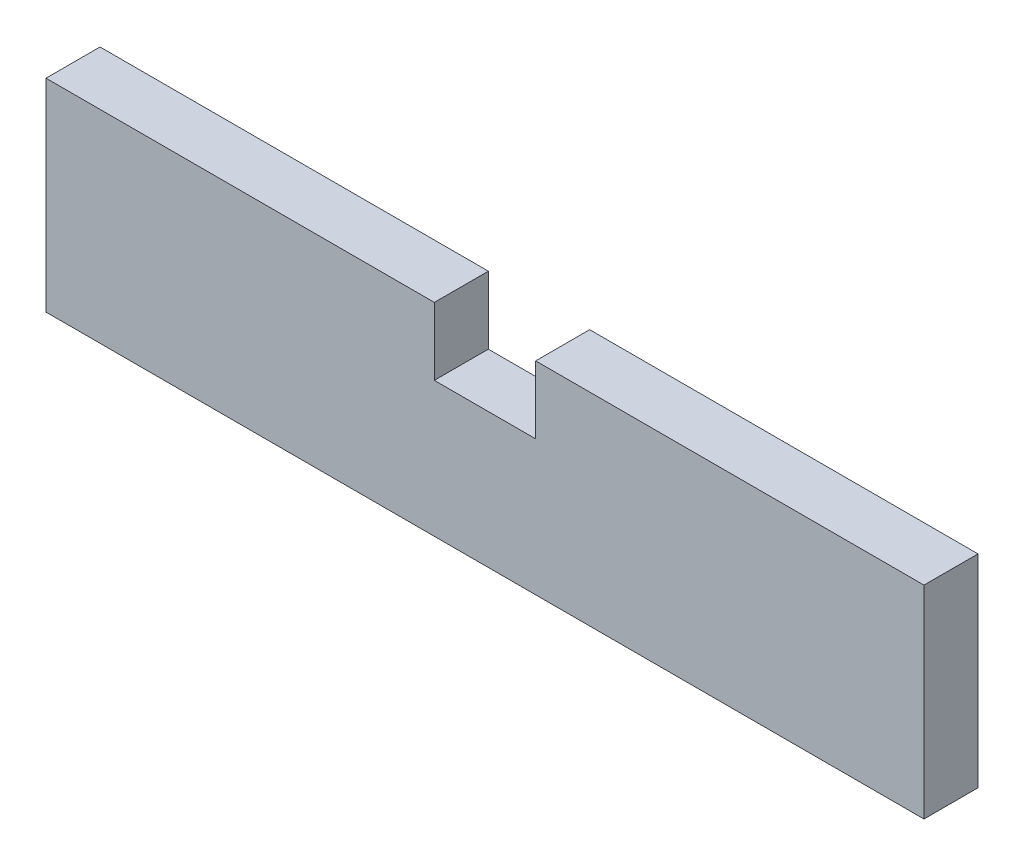
ISO-10303-21;
HEADER;
FILE_DESCRIPTION(('STEP AP214'),'2;1');
FILE_NAME('part.step','',(''),(''),'','','');
FILE_SCHEMA(('AUTOMOTIVE_DESIGN { 1 0 10303 214 1 1 1 1 }'));
ENDSEC;
DATA;
#1=APPLICATION_CONTEXT('core data for automotive mechanical design processes');
#2=APPLICATION_PROTOCOL_DEFINITION('international standard','automotive_design',2000,#1);
#3=PRODUCT_CONTEXT('',#1,'mechanical');
#4=PRODUCT('Part','Part','',(#3));
#5=PRODUCT_RELATED_PRODUCT_CATEGORY('part','',(#4));
#6=PRODUCT_DEFINITION_FORMATION('','',#4);
#7=PRODUCT_DEFINITION_CONTEXT('part definition',#1,'design');
#8=PRODUCT_DEFINITION('design','',#6,#7);
#9=PRODUCT_DEFINITION_SHAPE('','',#8);
#10=(LENGTH_UNIT() NAMED_UNIT(*) SI_UNIT(.MILLI.,.METRE.));
#11=(NAMED_UNIT(*) PLANE_ANGLE_UNIT() SI_UNIT($,.RADIAN.));
#12=(NAMED_UNIT(*) SI_UNIT($,.STERADIAN.) SOLID_ANGLE_UNIT());
#13=UNCERTAINTY_MEASURE_WITH_UNIT(LENGTH_MEASURE(1.E-05),#10,'distance_accuracy_value','');
#14=(GEOMETRIC_REPRESENTATION_CONTEXT(3) GLOBAL_UNCERTAINTY_ASSIGNED_CONTEXT((#13)) GLOBAL_UNIT_ASSIGNED_CONTEXT((#10,
#11,#12)) REPRESENTATION_CONTEXT('',''));
#15=CARTESIAN_POINT('',(0.,0.,0.));
#16=DIRECTION('',(0.,0.,1.));
#17=DIRECTION('',(1.,0.,0.));
#18=AXIS2_PLACEMENT_3D('',#15,#16,#17);
#19=CARTESIAN_POINT('',(0.,15.,4.));
#20=DIRECTION('',(0.,-1.,0.));
#21=DIRECTION('',(0.,0.,-1.));
#22=AXIS2_PLACEMENT_3D('',#19,#20,#21);
#23=PLANE('',#22);
#24=DIRECTION('',(-1.,0.,0.));
#25=VECTOR('',#24,1.);
#26=CARTESIAN_POINT('',(0.,15.,4.));
#27=LINE('',#26,#25);
#28=CARTESIAN_POINT('',(28.75,15.,4.));
#29=VERTEX_POINT('',#28);
#30=CARTESIAN_POINT('',(0.,15.,4.));
#31=VERTEX_POINT('',#30);
#32=EDGE_CURVE('E59',#29,#31,#27,.T.);
#33=ORIENTED_EDGE('',*,*,#32,.F.);
#34=DIRECTION('',(0.,0.,1.));
#35=VECTOR('',#34,1.);
#36=CARTESIAN_POINT('',(28.75,15.,-0.00100000000000013));
#37=LINE('',#36,#35);
#38=CARTESIAN_POINT('',(28.75,15.,0.));
#39=VERTEX_POINT('',#38);
#40=EDGE_CURVE('E120',#39,#29,#37,.T.);
#41=ORIENTED_EDGE('',*,*,#40,.F.);
#42=DIRECTION('',(-1.,0.,0.));
#43=VECTOR('',#42,1.);
#44=CARTESIAN_POINT('',(0.,15.,0.));
#45=LINE('',#44,#43);
#46=CARTESIAN_POINT('',(0.,15.,0.));
#47=VERTEX_POINT('',#46);
#48=EDGE_CURVE('E81',#39,#47,#45,.T.);
#49=ORIENTED_EDGE('',*,*,#48,.T.);
#50=DIRECTION('',(0.,0.,-1.));
#51=VECTOR('',#50,1.);
#52=CARTESIAN_POINT('',(0.,15.,4.));
#53=LINE('',#52,#51);
#54=EDGE_CURVE('E142',#31,#47,#53,.T.);
#55=ORIENTED_EDGE('',*,*,#54,.F.);
#56=EDGE_LOOP('',(#33,#41,#49,#55));
#57=FACE_BOUND('',#56,.T.);
#58=ADVANCED_FACE('F35',(#57),#23,.F.);
#59=CARTESIAN_POINT('',(0.,0.,4.));
#60=DIRECTION('',(1.,0.,0.));
#61=DIRECTION('',(0.,0.,-1.));
#62=AXIS2_PLACEMENT_3D('',#59,#60,#61);
#63=PLANE('',#62);
#64=DIRECTION('',(0.,-1.,0.));
#65=VECTOR('',#64,1.);
#66=CARTESIAN_POINT('',(0.,0.,0.));
#67=LINE('',#66,#65);
#68=CARTESIAN_POINT('',(0.,0.,0.));
#69=VERTEX_POINT('',#68);
#70=EDGE_CURVE('E152',#47,#69,#67,.T.);
#71=ORIENTED_EDGE('',*,*,#70,.T.);
#72=DIRECTION('',(0.,0.,-1.));
#73=VECTOR('',#72,1.);
#74=CARTESIAN_POINT('',(0.,0.,4.));
#75=LINE('',#74,#73);
#76=CARTESIAN_POINT('',(0.,0.,4.));
#77=VERTEX_POINT('',#76);
#78=EDGE_CURVE('E11',#77,#69,#75,.T.);
#79=ORIENTED_EDGE('',*,*,#78,.F.);
#80=DIRECTION('',(0.,-1.,0.));
#81=VECTOR('',#80,1.);
#82=CARTESIAN_POINT('',(0.,0.,4.));
#83=LINE('',#82,#81);
#84=EDGE_CURVE('E135',#31,#77,#83,.T.);
#85=ORIENTED_EDGE('',*,*,#84,.F.);
#86=ORIENTED_EDGE('',*,*,#54,.T.);
#87=EDGE_LOOP('',(#71,#79,#85,#86));
#88=FACE_BOUND('',#87,.T.);
#89=ADVANCED_FACE('F37',(#88),#63,.F.);
#90=CARTESIAN_POINT('',(0.,0.,4.));
#91=DIRECTION('',(0.,1.,0.));
#92=DIRECTION('',(0.,0.,1.));
#93=AXIS2_PLACEMENT_3D('',#90,#91,#92);
#94=PLANE('',#93);
#95=DIRECTION('',(1.,0.,0.));
#96=VECTOR('',#95,1.);
#97=CARTESIAN_POINT('',(0.,0.,0.));
#98=LINE('',#97,#96);
#99=CARTESIAN_POINT('',(65.,0.,0.));
#100=VERTEX_POINT('',#99);
#101=EDGE_CURVE('E151',#69,#100,#98,.T.);
#102=ORIENTED_EDGE('',*,*,#101,.T.);
#103=DIRECTION('',(0.,0.,-1.));
#104=VECTOR('',#103,1.);
#105=CARTESIAN_POINT('',(65.,0.,4.));
#106=LINE('',#105,#104);
#107=CARTESIAN_POINT('',(65.,0.,4.));
#108=VERTEX_POINT('',#107);
#109=EDGE_CURVE('E43',#108,#100,#106,.T.);
#110=ORIENTED_EDGE('',*,*,#109,.F.);
#111=DIRECTION('',(1.,0.,0.));
#112=VECTOR('',#111,1.);
#113=CARTESIAN_POINT('',(0.,0.,4.));
#114=LINE('',#113,#112);
#115=EDGE_CURVE('E88',#77,#108,#114,.T.);
#116=ORIENTED_EDGE('',*,*,#115,.F.);
#117=ORIENTED_EDGE('',*,*,#78,.T.);
#118=EDGE_LOOP('',(#102,#110,#116,#117));
#119=FACE_BOUND('',#118,.T.);
#120=ADVANCED_FACE('F191',(#119),#94,.F.);
#121=CARTESIAN_POINT('',(65.,0.,4.));
#122=DIRECTION('',(-1.,0.,0.));
#123=DIRECTION('',(0.,0.,1.));
#124=AXIS2_PLACEMENT_3D('',#121,#122,#123);
#125=PLANE('',#124);
#126=DIRECTION('',(0.,1.,0.));
#127=VECTOR('',#126,1.);
#128=CARTESIAN_POINT('',(65.,0.,0.));
#129=LINE('',#128,#127);
#130=CARTESIAN_POINT('',(65.,15.,0.));
#131=VERTEX_POINT('',#130);
#132=EDGE_CURVE('E138',#100,#131,#129,.T.);
#133=ORIENTED_EDGE('',*,*,#132,.T.);
#134=DIRECTION('',(0.,0.,-1.));
#135=VECTOR('',#134,1.);
#136=CARTESIAN_POINT('',(65.,15.,4.));
#137=LINE('',#136,#135);
#138=CARTESIAN_POINT('',(65.,15.,4.));
#139=VERTEX_POINT('',#138);
#140=EDGE_CURVE('E134',#139,#131,#137,.T.);
#141=ORIENTED_EDGE('',*,*,#140,.F.);
#142=DIRECTION('',(0.,1.,0.));
#143=VECTOR('',#142,1.);
#144=CARTESIAN_POINT('',(65.,0.,4.));
#145=LINE('',#144,#143);
#146=EDGE_CURVE('E149',#108,#139,#145,.T.);
#147=ORIENTED_EDGE('',*,*,#146,.F.);
#148=ORIENTED_EDGE('',*,*,#109,.T.);
#149=EDGE_LOOP('',(#133,#141,#147,#148));
#150=FACE_BOUND('',#149,.T.);
#151=ADVANCED_FACE('F148',(#150),#125,.F.);
#152=CARTESIAN_POINT('',(36.25,15.,0.));
#153=VERTEX_POINT('',#152);
#154=EDGE_CURVE('E127',#131,#153,#45,.T.);
#155=ORIENTED_EDGE('',*,*,#154,.T.);
#156=DIRECTION('',(0.,0.,1.));
#157=VECTOR('',#156,1.);
#158=CARTESIAN_POINT('',(36.25,15.,-0.00100000000000013));
#159=LINE('',#158,#157);
#160=CARTESIAN_POINT('',(36.25,15.,4.));
#161=VERTEX_POINT('',#160);
#162=EDGE_CURVE('E109',#153,#161,#159,.T.);
#163=ORIENTED_EDGE('',*,*,#162,.T.);
#164=EDGE_CURVE('E144',#139,#161,#27,.T.);
#165=ORIENTED_EDGE('',*,*,#164,.F.);
#166=ORIENTED_EDGE('',*,*,#140,.T.);
#167=EDGE_LOOP('',(#155,#163,#165,#166));
#168=FACE_BOUND('',#167,.T.);
#169=ADVANCED_FACE('F132',(#168),#23,.F.);
#170=CARTESIAN_POINT('',(0.,0.,4.));
#171=DIRECTION('',(0.,0.,-1.));
#172=DIRECTION('',(-1.,0.,0.));
#173=AXIS2_PLACEMENT_3D('',#170,#171,#172);
#174=PLANE('',#173);
#175=DIRECTION('',(1.,0.,0.));
#176=VECTOR('',#175,1.);
#177=CARTESIAN_POINT('',(28.75,10.,4.));
#178=LINE('',#177,#176);
#179=CARTESIAN_POINT('',(28.75,10.,4.));
#180=VERTEX_POINT('',#179);
#181=CARTESIAN_POINT('',(36.25,10.,4.));
#182=VERTEX_POINT('',#181);
#183=EDGE_CURVE('E165',#180,#182,#178,.T.);
#184=ORIENTED_EDGE('',*,*,#183,.F.);
#185=DIRECTION('',(0.,-1.,0.));
#186=VECTOR('',#185,1.);
#187=CARTESIAN_POINT('',(28.75,15.,4.));
#188=LINE('',#187,#186);
#189=EDGE_CURVE('E167',#29,#180,#188,.T.);
#190=ORIENTED_EDGE('',*,*,#189,.F.);
#191=ORIENTED_EDGE('',*,*,#32,.T.);
#192=ORIENTED_EDGE('',*,*,#84,.T.);
#193=ORIENTED_EDGE('',*,*,#115,.T.);
#194=ORIENTED_EDGE('',*,*,#146,.T.);
#195=ORIENTED_EDGE('',*,*,#164,.T.);
#196=DIRECTION('',(0.,1.,0.));
#197=VECTOR('',#196,1.);
#198=CARTESIAN_POINT('',(36.25,15.,4.));
#199=LINE('',#198,#197);
#200=EDGE_CURVE('E115',#182,#161,#199,.T.);
#201=ORIENTED_EDGE('',*,*,#200,.F.);
#202=EDGE_LOOP('',(#184,#190,#191,#192,#193,#194,#195,#201));
#203=FACE_BOUND('',#202,.T.);
#204=ADVANCED_FACE('F177',(#203),#174,.F.);
#205=CARTESIAN_POINT('',(0.,0.,0.));
#206=DIRECTION('',(0.,0.,-1.));
#207=DIRECTION('',(-1.,0.,0.));
#208=AXIS2_PLACEMENT_3D('',#205,#206,#207);
#209=PLANE('',#208);
#210=DIRECTION('',(0.,-1.,0.));
#211=VECTOR('',#210,1.);
#212=CARTESIAN_POINT('',(28.75,15.,0.));
#213=LINE('',#212,#211);
#214=CARTESIAN_POINT('',(28.75,10.,0.));
#215=VERTEX_POINT('',#214);
#216=EDGE_CURVE('E129',#39,#215,#213,.T.);
#217=ORIENTED_EDGE('',*,*,#216,.T.);
#218=DIRECTION('',(1.,0.,0.));
#219=VECTOR('',#218,1.);
#220=CARTESIAN_POINT('',(28.75,10.,0.));
#221=LINE('',#220,#219);
#222=CARTESIAN_POINT('',(36.25,10.,0.));
#223=VERTEX_POINT('',#222);
#224=EDGE_CURVE('E128',#215,#223,#221,.T.);
#225=ORIENTED_EDGE('',*,*,#224,.T.);
#226=DIRECTION('',(0.,1.,0.));
#227=VECTOR('',#226,1.);
#228=CARTESIAN_POINT('',(36.25,15.,0.));
#229=LINE('',#228,#227);
#230=EDGE_CURVE('E112',#223,#153,#229,.T.);
#231=ORIENTED_EDGE('',*,*,#230,.T.);
#232=ORIENTED_EDGE('',*,*,#154,.F.);
#233=ORIENTED_EDGE('',*,*,#132,.F.);
#234=ORIENTED_EDGE('',*,*,#101,.F.);
#235=ORIENTED_EDGE('',*,*,#70,.F.);
#236=ORIENTED_EDGE('',*,*,#48,.F.);
#237=EDGE_LOOP('',(#217,#225,#231,#232,#233,#234,#235,#236));
#238=FACE_BOUND('',#237,.T.);
#239=ADVANCED_FACE('F125',(#238),#209,.T.);
#240=CARTESIAN_POINT('',(28.75,15.,-0.00100000000000013));
#241=DIRECTION('',(-1.,0.,0.));
#242=DIRECTION('',(0.,-1.,0.));
#243=AXIS2_PLACEMENT_3D('',#240,#241,#242);
#244=PLANE('',#243);
#245=ORIENTED_EDGE('',*,*,#40,.T.);
#246=ORIENTED_EDGE('',*,*,#189,.T.);
#247=DIRECTION('',(0.,0.,1.));
#248=VECTOR('',#247,1.);
#249=CARTESIAN_POINT('',(28.75,10.,-0.00100000000000013));
#250=LINE('',#249,#248);
#251=EDGE_CURVE('E160',#215,#180,#250,.T.);
#252=ORIENTED_EDGE('',*,*,#251,.F.);
#253=ORIENTED_EDGE('',*,*,#216,.F.);
#254=EDGE_LOOP('',(#245,#246,#252,#253));
#255=FACE_BOUND('',#254,.T.);
#256=ADVANCED_FACE('F172',(#255),#244,.F.);
#257=CARTESIAN_POINT('',(36.25,15.,-0.00100000000000013));
#258=DIRECTION('',(1.,0.,0.));
#259=DIRECTION('',(0.,0.,-1.));
#260=AXIS2_PLACEMENT_3D('',#257,#258,#259);
#261=PLANE('',#260);
#262=DIRECTION('',(0.,0.,1.));
#263=VECTOR('',#262,1.);
#264=CARTESIAN_POINT('',(36.25,10.,-0.00100000000000013));
#265=LINE('',#264,#263);
#266=EDGE_CURVE('E50',#223,#182,#265,.T.);
#267=ORIENTED_EDGE('',*,*,#266,.T.);
#268=ORIENTED_EDGE('',*,*,#200,.T.);
#269=ORIENTED_EDGE('',*,*,#162,.F.);
#270=ORIENTED_EDGE('',*,*,#230,.F.);
#271=EDGE_LOOP('',(#267,#268,#269,#270));
#272=FACE_BOUND('',#271,.T.);
#273=ADVANCED_FACE('F111',(#272),#261,.F.);
#274=CARTESIAN_POINT('',(28.75,10.,-0.00100000000000013));
#275=DIRECTION('',(0.,-1.,0.));
#276=DIRECTION('',(1.,0.,0.));
#277=AXIS2_PLACEMENT_3D('',#274,#275,#276);
#278=PLANE('',#277);
#279=ORIENTED_EDGE('',*,*,#251,.T.);
#280=ORIENTED_EDGE('',*,*,#183,.T.);
#281=ORIENTED_EDGE('',*,*,#266,.F.);
#282=ORIENTED_EDGE('',*,*,#224,.F.);
#283=EDGE_LOOP('',(#279,#280,#281,#282));
#284=FACE_BOUND('',#283,.T.);
#285=ADVANCED_FACE('F178',(#284),#278,.F.);
#286=CLOSED_SHELL('',(#58,#89,#120,#151,#169,#204,#239,#256,#273,#285));
#287=MANIFOLD_SOLID_BREP('B2',#286);
#288=ADVANCED_BREP_SHAPE_REPRESENTATION('',(#18,#287),#14);
#289=SHAPE_DEFINITION_REPRESENTATION(#9,#288);
ENDSEC;
END-ISO-10303-21;
